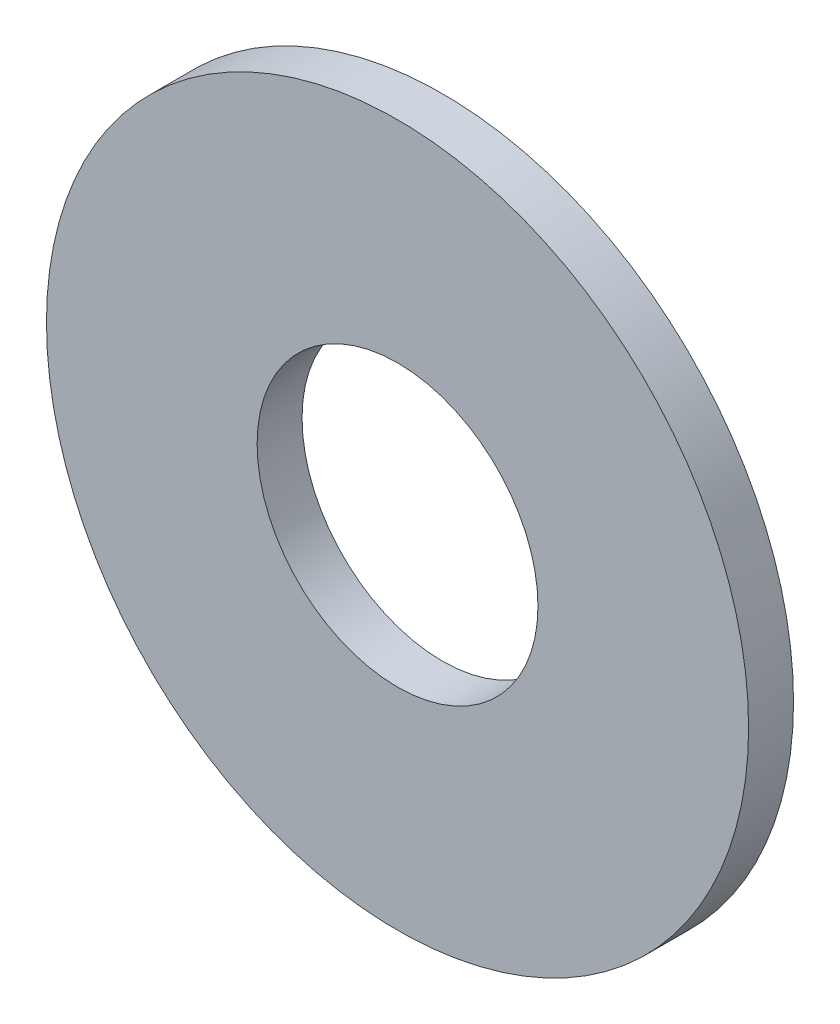
ISO-10303-21;
HEADER;
FILE_DESCRIPTION(('STEP AP214'),'2;1');
FILE_NAME('part.step','',(''),(''),'','','');
FILE_SCHEMA(('AUTOMOTIVE_DESIGN { 1 0 10303 214 1 1 1 1 }'));
ENDSEC;
DATA;
#1=APPLICATION_CONTEXT('core data for automotive mechanical design processes');
#2=APPLICATION_PROTOCOL_DEFINITION('international standard','automotive_design',2000,#1);
#3=PRODUCT_CONTEXT('',#1,'mechanical');
#4=PRODUCT('Part','Part','',(#3));
#5=PRODUCT_RELATED_PRODUCT_CATEGORY('part','',(#4));
#6=PRODUCT_DEFINITION_FORMATION('','',#4);
#7=PRODUCT_DEFINITION_CONTEXT('part definition',#1,'design');
#8=PRODUCT_DEFINITION('design','',#6,#7);
#9=PRODUCT_DEFINITION_SHAPE('','',#8);
#10=(LENGTH_UNIT() NAMED_UNIT(*) SI_UNIT(.MILLI.,.METRE.));
#11=(NAMED_UNIT(*) PLANE_ANGLE_UNIT() SI_UNIT($,.RADIAN.));
#12=(NAMED_UNIT(*) SI_UNIT($,.STERADIAN.) SOLID_ANGLE_UNIT());
#13=UNCERTAINTY_MEASURE_WITH_UNIT(LENGTH_MEASURE(1.E-05),#10,'distance_accuracy_value','');
#14=(GEOMETRIC_REPRESENTATION_CONTEXT(3) GLOBAL_UNCERTAINTY_ASSIGNED_CONTEXT((#13)) GLOBAL_UNIT_ASSIGNED_CONTEXT((#10,
#11,#12)) REPRESENTATION_CONTEXT('',''));
#15=CARTESIAN_POINT('',(0.,0.,0.));
#16=DIRECTION('',(0.,0.,1.));
#17=DIRECTION('',(1.,0.,0.));
#18=AXIS2_PLACEMENT_3D('',#15,#16,#17);
#19=CARTESIAN_POINT('',(0.,0.,-0.508));
#20=DIRECTION('',(0.,0.,1.));
#21=DIRECTION('',(1.,0.,0.));
#22=AXIS2_PLACEMENT_3D('',#19,#20,#21);
#23=CYLINDRICAL_SURFACE('',#22,3.96875);
#24=CARTESIAN_POINT('',(0.,0.,-0.508));
#25=DIRECTION('',(0.,0.,1.));
#26=DIRECTION('',(1.,0.,0.));
#27=AXIS2_PLACEMENT_3D('',#24,#25,#26);
#28=CIRCLE('',#27,3.96875);
#29=CARTESIAN_POINT('',(3.96875,0.,-0.508));
#30=VERTEX_POINT('',#29);
#31=EDGE_CURVE('E10',#30,#30,#28,.T.);
#32=ORIENTED_EDGE('',*,*,#31,.T.);
#33=EDGE_LOOP('',(#32));
#34=FACE_BOUND('',#33,.T.);
#35=CARTESIAN_POINT('',(0.,0.,0.));
#36=DIRECTION('',(0.,0.,1.));
#37=DIRECTION('',(1.,0.,0.));
#38=AXIS2_PLACEMENT_3D('',#35,#36,#37);
#39=CIRCLE('',#38,3.96875);
#40=CARTESIAN_POINT('',(3.96875,0.,0.));
#41=VERTEX_POINT('',#40);
#42=EDGE_CURVE('E33',#41,#41,#39,.T.);
#43=ORIENTED_EDGE('',*,*,#42,.F.);
#44=EDGE_LOOP('',(#43));
#45=FACE_BOUND('',#44,.T.);
#46=ADVANCED_FACE('F30',(#34,#45),#23,.T.);
#47=CARTESIAN_POINT('',(0.,0.,-0.508));
#48=DIRECTION('',(0.,0.,1.));
#49=DIRECTION('',(1.,0.,0.));
#50=AXIS2_PLACEMENT_3D('',#47,#48,#49);
#51=PLANE('',#50);
#52=CARTESIAN_POINT('',(0.,0.,-0.508));
#53=DIRECTION('',(0.,0.,1.));
#54=DIRECTION('',(1.,0.,0.));
#55=AXIS2_PLACEMENT_3D('',#52,#53,#54);
#56=CIRCLE('',#55,1.5875);
#57=CARTESIAN_POINT('',(1.5875,0.,-0.508));
#58=VERTEX_POINT('',#57);
#59=EDGE_CURVE('E40',#58,#58,#56,.T.);
#60=ORIENTED_EDGE('',*,*,#59,.T.);
#61=EDGE_LOOP('',(#60));
#62=FACE_BOUND('',#61,.T.);
#63=ORIENTED_EDGE('',*,*,#31,.F.);
#64=EDGE_LOOP('',(#63));
#65=FACE_BOUND('',#64,.T.);
#66=ADVANCED_FACE('F48',(#62,#65),#51,.F.);
#67=CARTESIAN_POINT('',(0.,0.,0.));
#68=DIRECTION('',(0.,0.,1.));
#69=DIRECTION('',(1.,0.,0.));
#70=AXIS2_PLACEMENT_3D('',#67,#68,#69);
#71=PLANE('',#70);
#72=CARTESIAN_POINT('',(0.,0.,0.));
#73=DIRECTION('',(0.,0.,1.));
#74=DIRECTION('',(1.,0.,0.));
#75=AXIS2_PLACEMENT_3D('',#72,#73,#74);
#76=CIRCLE('',#75,1.5875);
#77=CARTESIAN_POINT('',(1.5875,0.,0.));
#78=VERTEX_POINT('',#77);
#79=EDGE_CURVE('E42',#78,#78,#76,.T.);
#80=ORIENTED_EDGE('',*,*,#79,.F.);
#81=EDGE_LOOP('',(#80));
#82=FACE_BOUND('',#81,.T.);
#83=ORIENTED_EDGE('',*,*,#42,.T.);
#84=EDGE_LOOP('',(#83));
#85=FACE_BOUND('',#84,.T.);
#86=ADVANCED_FACE('F54',(#82,#85),#71,.T.);
#87=CARTESIAN_POINT('',(0.,0.,-0.508));
#88=DIRECTION('',(0.,0.,1.));
#89=DIRECTION('',(1.,0.,0.));
#90=AXIS2_PLACEMENT_3D('',#87,#88,#89);
#91=CYLINDRICAL_SURFACE('',#90,1.5875);
#92=ORIENTED_EDGE('',*,*,#59,.F.);
#93=EDGE_LOOP('',(#92));
#94=FACE_BOUND('',#93,.T.);
#95=ORIENTED_EDGE('',*,*,#79,.T.);
#96=EDGE_LOOP('',(#95));
#97=FACE_BOUND('',#96,.T.);
#98=ADVANCED_FACE('F51',(#94,#97),#91,.F.);
#99=CLOSED_SHELL('',(#46,#66,#86,#98));
#100=MANIFOLD_SOLID_BREP('B2',#99);
#101=ADVANCED_BREP_SHAPE_REPRESENTATION('',(#18,#100),#14);
#102=SHAPE_DEFINITION_REPRESENTATION(#9,#101);
ENDSEC;
END-ISO-10303-21;
